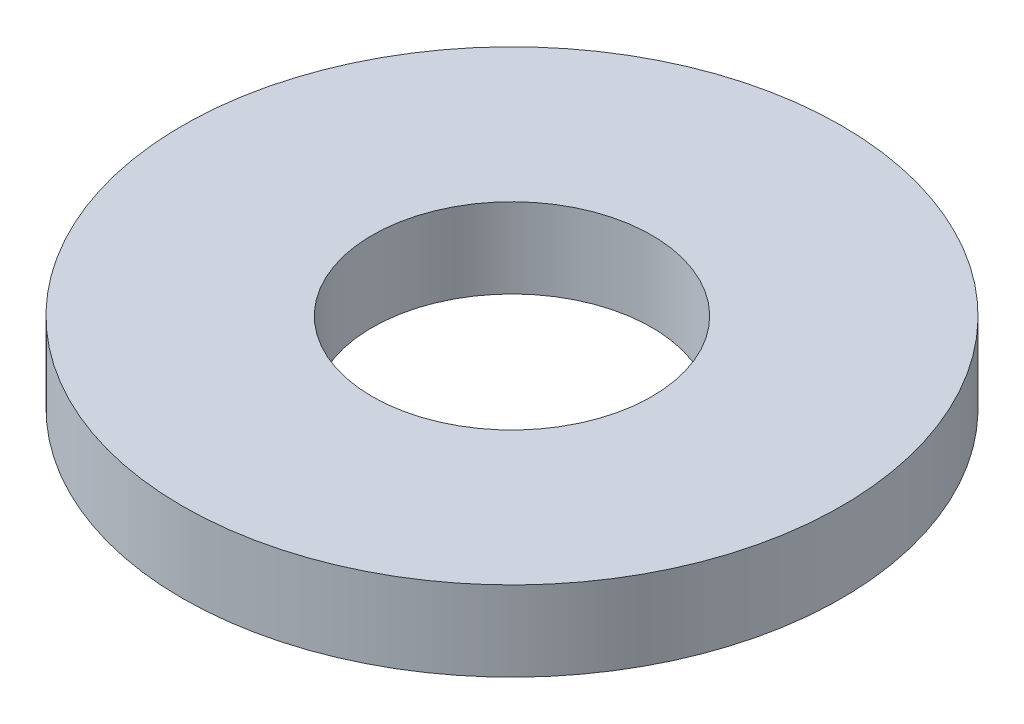
ISO-10303-21;
HEADER;
FILE_DESCRIPTION(('STEP AP214'),'2;1');
FILE_NAME('part.step','',(''),(''),'','','');
FILE_SCHEMA(('AUTOMOTIVE_DESIGN { 1 0 10303 214 1 1 1 1 }'));
ENDSEC;
DATA;
#1=APPLICATION_CONTEXT('core data for automotive mechanical design processes');
#2=APPLICATION_PROTOCOL_DEFINITION('international standard','automotive_design',2000,#1);
#3=PRODUCT_CONTEXT('',#1,'mechanical');
#4=PRODUCT('Part','Part','',(#3));
#5=PRODUCT_RELATED_PRODUCT_CATEGORY('part','',(#4));
#6=PRODUCT_DEFINITION_FORMATION('','',#4);
#7=PRODUCT_DEFINITION_CONTEXT('part definition',#1,'design');
#8=PRODUCT_DEFINITION('design','',#6,#7);
#9=PRODUCT_DEFINITION_SHAPE('','',#8);
#10=(LENGTH_UNIT() NAMED_UNIT(*) SI_UNIT(.MILLI.,.METRE.));
#11=(NAMED_UNIT(*) PLANE_ANGLE_UNIT() SI_UNIT($,.RADIAN.));
#12=(NAMED_UNIT(*) SI_UNIT($,.STERADIAN.) SOLID_ANGLE_UNIT());
#13=UNCERTAINTY_MEASURE_WITH_UNIT(LENGTH_MEASURE(1.E-05),#10,'distance_accuracy_value','');
#14=(GEOMETRIC_REPRESENTATION_CONTEXT(3) GLOBAL_UNCERTAINTY_ASSIGNED_CONTEXT((#13)) GLOBAL_UNIT_ASSIGNED_CONTEXT((#10,
#11,#12)) REPRESENTATION_CONTEXT('',''));
#15=CARTESIAN_POINT('',(0.,0.,0.));
#16=DIRECTION('',(0.,0.,1.));
#17=DIRECTION('',(1.,0.,0.));
#18=AXIS2_PLACEMENT_3D('',#15,#16,#17);
#19=CARTESIAN_POINT('',(0.,20.,0.));
#20=DIRECTION('',(0.,-1.,0.));
#21=DIRECTION('',(0.,0.,-1.));
#22=AXIS2_PLACEMENT_3D('',#19,#20,#21);
#23=CYLINDRICAL_SURFACE('',#22,82.5);
#24=CARTESIAN_POINT('',(0.,20.,0.));
#25=DIRECTION('',(0.,1.,0.));
#26=DIRECTION('',(0.,0.,1.));
#27=AXIS2_PLACEMENT_3D('',#24,#25,#26);
#28=CIRCLE('',#27,82.5);
#29=CARTESIAN_POINT('',(0.,20.,82.5));
#30=VERTEX_POINT('',#29);
#31=EDGE_CURVE('E10',#30,#30,#28,.T.);
#32=ORIENTED_EDGE('',*,*,#31,.F.);
#33=EDGE_LOOP('',(#32));
#34=FACE_BOUND('',#33,.T.);
#35=CARTESIAN_POINT('',(0.,0.,0.));
#36=DIRECTION('',(0.,1.,0.));
#37=DIRECTION('',(0.,0.,1.));
#38=AXIS2_PLACEMENT_3D('',#35,#36,#37);
#39=CIRCLE('',#38,82.5);
#40=CARTESIAN_POINT('',(0.,0.,82.5));
#41=VERTEX_POINT('',#40);
#42=EDGE_CURVE('E37',#41,#41,#39,.T.);
#43=ORIENTED_EDGE('',*,*,#42,.T.);
#44=EDGE_LOOP('',(#43));
#45=FACE_BOUND('',#44,.T.);
#46=ADVANCED_FACE('F40',(#34,#45),#23,.T.);
#47=CARTESIAN_POINT('',(0.,20.,0.));
#48=DIRECTION('',(0.,1.,0.));
#49=DIRECTION('',(0.,0.,1.));
#50=AXIS2_PLACEMENT_3D('',#47,#48,#49);
#51=PLANE('',#50);
#52=CARTESIAN_POINT('',(0.,20.,0.));
#53=DIRECTION('',(0.,1.,0.));
#54=DIRECTION('',(0.,0.,1.));
#55=AXIS2_PLACEMENT_3D('',#52,#53,#54);
#56=CIRCLE('',#55,35.);
#57=CARTESIAN_POINT('',(0.,20.,35.));
#58=VERTEX_POINT('',#57);
#59=EDGE_CURVE('E50',#58,#58,#56,.T.);
#60=ORIENTED_EDGE('',*,*,#59,.F.);
#61=EDGE_LOOP('',(#60));
#62=FACE_BOUND('',#61,.T.);
#63=ORIENTED_EDGE('',*,*,#31,.T.);
#64=EDGE_LOOP('',(#63));
#65=FACE_BOUND('',#64,.T.);
#66=ADVANCED_FACE('F59',(#62,#65),#51,.T.);
#67=CARTESIAN_POINT('',(0.,0.,0.));
#68=DIRECTION('',(0.,1.,0.));
#69=DIRECTION('',(0.,0.,1.));
#70=AXIS2_PLACEMENT_3D('',#67,#68,#69);
#71=PLANE('',#70);
#72=CARTESIAN_POINT('',(0.,0.,0.));
#73=DIRECTION('',(0.,1.,0.));
#74=DIRECTION('',(0.,0.,1.));
#75=AXIS2_PLACEMENT_3D('',#72,#73,#74);
#76=CIRCLE('',#75,35.);
#77=CARTESIAN_POINT('',(0.,0.,35.));
#78=VERTEX_POINT('',#77);
#79=EDGE_CURVE('E47',#78,#78,#76,.T.);
#80=ORIENTED_EDGE('',*,*,#79,.T.);
#81=EDGE_LOOP('',(#80));
#82=FACE_BOUND('',#81,.T.);
#83=ORIENTED_EDGE('',*,*,#42,.F.);
#84=EDGE_LOOP('',(#83));
#85=FACE_BOUND('',#84,.T.);
#86=ADVANCED_FACE('F58',(#82,#85),#71,.F.);
#87=CARTESIAN_POINT('',(0.,20.,0.));
#88=DIRECTION('',(0.,-1.,0.));
#89=DIRECTION('',(0.,0.,-1.));
#90=AXIS2_PLACEMENT_3D('',#87,#88,#89);
#91=CYLINDRICAL_SURFACE('',#90,35.);
#92=ORIENTED_EDGE('',*,*,#59,.T.);
#93=EDGE_LOOP('',(#92));
#94=FACE_BOUND('',#93,.T.);
#95=ORIENTED_EDGE('',*,*,#79,.F.);
#96=EDGE_LOOP('',(#95));
#97=FACE_BOUND('',#96,.T.);
#98=ADVANCED_FACE('F54',(#94,#97),#91,.F.);
#99=CLOSED_SHELL('',(#46,#66,#86,#98));
#100=MANIFOLD_SOLID_BREP('B2',#99);
#101=ADVANCED_BREP_SHAPE_REPRESENTATION('',(#18,#100),#14);
#102=SHAPE_DEFINITION_REPRESENTATION(#9,#101);
ENDSEC;
END-ISO-10303-21;
